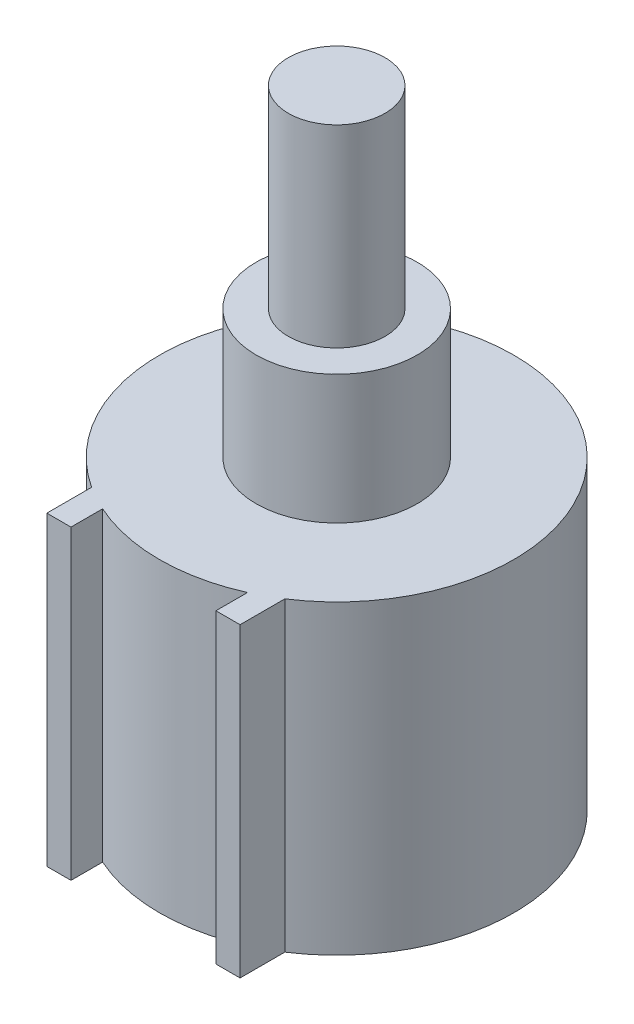
ISO-10303-21;
HEADER;
FILE_DESCRIPTION(('STEP AP214'),'2;1');
FILE_NAME('part.step','',(''),(''),'','','');
FILE_SCHEMA(('AUTOMOTIVE_DESIGN { 1 0 10303 214 1 1 1 1 }'));
ENDSEC;
DATA;
#1=APPLICATION_CONTEXT('core data for automotive mechanical design processes');
#2=APPLICATION_PROTOCOL_DEFINITION('international standard','automotive_design',2000,#1);
#3=PRODUCT_CONTEXT('',#1,'mechanical');
#4=PRODUCT('Part','Part','',(#3));
#5=PRODUCT_RELATED_PRODUCT_CATEGORY('part','',(#4));
#6=PRODUCT_DEFINITION_FORMATION('','',#4);
#7=PRODUCT_DEFINITION_CONTEXT('part definition',#1,'design');
#8=PRODUCT_DEFINITION('design','',#6,#7);
#9=PRODUCT_DEFINITION_SHAPE('','',#8);
#10=(LENGTH_UNIT() NAMED_UNIT(*) SI_UNIT(.MILLI.,.METRE.));
#11=(NAMED_UNIT(*) PLANE_ANGLE_UNIT() SI_UNIT($,.RADIAN.));
#12=(NAMED_UNIT(*) SI_UNIT($,.STERADIAN.) SOLID_ANGLE_UNIT());
#13=UNCERTAINTY_MEASURE_WITH_UNIT(LENGTH_MEASURE(1.E-05),#10,'distance_accuracy_value','');
#14=(GEOMETRIC_REPRESENTATION_CONTEXT(3) GLOBAL_UNCERTAINTY_ASSIGNED_CONTEXT((#13)) GLOBAL_UNIT_ASSIGNED_CONTEXT((#10,
#11,#12)) REPRESENTATION_CONTEXT('',''));
#15=CARTESIAN_POINT('',(0.,0.,0.));
#16=DIRECTION('',(0.,0.,1.));
#17=DIRECTION('',(1.,0.,0.));
#18=AXIS2_PLACEMENT_3D('',#15,#16,#17);
#19=CARTESIAN_POINT('',(0.,19.,0.));
#20=DIRECTION('',(0.,-1.,0.));
#21=DIRECTION('',(0.,0.,-1.));
#22=AXIS2_PLACEMENT_3D('',#19,#20,#21);
#23=CYLINDRICAL_SURFACE('',#22,11.);
#24=CARTESIAN_POINT('',(0.,0.,0.));
#25=DIRECTION('',(0.,1.,0.));
#26=DIRECTION('',(0.,0.,1.));
#27=AXIS2_PLACEMENT_3D('',#24,#25,#26);
#28=CIRCLE('',#27,11.);
#29=CARTESIAN_POINT('',(-4.5,0.,10.0374299499424));
#30=VERTEX_POINT('',#29);
#31=CARTESIAN_POINT('',(4.5,0.,10.0374299499424));
#32=VERTEX_POINT('',#31);
#33=EDGE_CURVE('E144',#30,#32,#28,.T.);
#34=ORIENTED_EDGE('',*,*,#33,.T.);
#35=DIRECTION('',(0.,-1.,0.));
#36=VECTOR('',#35,1.);
#37=CARTESIAN_POINT('',(4.5,19.,10.0374299499424));
#38=LINE('',#37,#36);
#39=CARTESIAN_POINT('',(4.5,19.,10.0374299499424));
#40=VERTEX_POINT('',#39);
#41=EDGE_CURVE('E48',#40,#32,#38,.T.);
#42=ORIENTED_EDGE('',*,*,#41,.F.);
#43=CARTESIAN_POINT('',(0.,19.,0.));
#44=DIRECTION('',(0.,1.,0.));
#45=DIRECTION('',(0.,0.,1.));
#46=AXIS2_PLACEMENT_3D('',#43,#44,#45);
#47=CIRCLE('',#46,11.);
#48=CARTESIAN_POINT('',(-4.5,19.,10.0374299499424));
#49=VERTEX_POINT('',#48);
#50=EDGE_CURVE('E159',#49,#40,#47,.T.);
#51=ORIENTED_EDGE('',*,*,#50,.F.);
#52=DIRECTION('',(0.,-1.,0.));
#53=VECTOR('',#52,1.);
#54=CARTESIAN_POINT('',(-4.5,19.,10.0374299499424));
#55=LINE('',#54,#53);
#56=EDGE_CURVE('E140',#49,#30,#55,.T.);
#57=ORIENTED_EDGE('',*,*,#56,.T.);
#58=EDGE_LOOP('',(#34,#42,#51,#57));
#59=FACE_BOUND('',#58,.T.);
#60=ADVANCED_FACE('F45',(#59),#23,.T.);
#61=CARTESIAN_POINT('',(4.5,19.,12.));
#62=DIRECTION('',(1.,0.,0.));
#63=DIRECTION('',(0.,0.,-1.));
#64=AXIS2_PLACEMENT_3D('',#61,#62,#63);
#65=PLANE('',#64);
#66=DIRECTION('',(0.,0.,1.));
#67=VECTOR('',#66,1.);
#68=CARTESIAN_POINT('',(4.5,0.,12.));
#69=LINE('',#68,#67);
#70=CARTESIAN_POINT('',(4.5,0.,12.));
#71=VERTEX_POINT('',#70);
#72=EDGE_CURVE('E147',#32,#71,#69,.T.);
#73=ORIENTED_EDGE('',*,*,#72,.T.);
#74=DIRECTION('',(0.,-1.,0.));
#75=VECTOR('',#74,1.);
#76=CARTESIAN_POINT('',(4.5,19.,12.));
#77=LINE('',#76,#75);
#78=CARTESIAN_POINT('',(4.5,19.,12.));
#79=VERTEX_POINT('',#78);
#80=EDGE_CURVE('E168',#79,#71,#77,.T.);
#81=ORIENTED_EDGE('',*,*,#80,.F.);
#82=DIRECTION('',(0.,0.,1.));
#83=VECTOR('',#82,1.);
#84=CARTESIAN_POINT('',(4.5,19.,12.));
#85=LINE('',#84,#83);
#86=EDGE_CURVE('E107',#40,#79,#85,.T.);
#87=ORIENTED_EDGE('',*,*,#86,.F.);
#88=ORIENTED_EDGE('',*,*,#41,.T.);
#89=EDGE_LOOP('',(#73,#81,#87,#88));
#90=FACE_BOUND('',#89,.T.);
#91=ADVANCED_FACE('F211',(#90),#65,.F.);
#92=CARTESIAN_POINT('',(4.5,19.,12.));
#93=DIRECTION('',(0.,0.,-1.));
#94=DIRECTION('',(-1.,0.,0.));
#95=AXIS2_PLACEMENT_3D('',#92,#93,#94);
#96=PLANE('',#95);
#97=DIRECTION('',(1.,0.,0.));
#98=VECTOR('',#97,1.);
#99=CARTESIAN_POINT('',(4.5,0.,12.));
#100=LINE('',#99,#98);
#101=CARTESIAN_POINT('',(6.,0.,12.));
#102=VERTEX_POINT('',#101);
#103=EDGE_CURVE('E150',#71,#102,#100,.T.);
#104=ORIENTED_EDGE('',*,*,#103,.T.);
#105=DIRECTION('',(0.,-1.,0.));
#106=VECTOR('',#105,1.);
#107=CARTESIAN_POINT('',(6.,19.,12.));
#108=LINE('',#107,#106);
#109=CARTESIAN_POINT('',(6.,19.,12.));
#110=VERTEX_POINT('',#109);
#111=EDGE_CURVE('E166',#110,#102,#108,.T.);
#112=ORIENTED_EDGE('',*,*,#111,.F.);
#113=DIRECTION('',(1.,0.,0.));
#114=VECTOR('',#113,1.);
#115=CARTESIAN_POINT('',(4.5,19.,12.));
#116=LINE('',#115,#114);
#117=EDGE_CURVE('E182',#79,#110,#116,.T.);
#118=ORIENTED_EDGE('',*,*,#117,.F.);
#119=ORIENTED_EDGE('',*,*,#80,.T.);
#120=EDGE_LOOP('',(#104,#112,#118,#119));
#121=FACE_BOUND('',#120,.T.);
#122=ADVANCED_FACE('F215',(#121),#96,.F.);
#123=CARTESIAN_POINT('',(6.,19.,12.));
#124=DIRECTION('',(-1.,0.,0.));
#125=DIRECTION('',(0.,0.,1.));
#126=AXIS2_PLACEMENT_3D('',#123,#124,#125);
#127=PLANE('',#126);
#128=DIRECTION('',(0.,0.,-1.));
#129=VECTOR('',#128,1.);
#130=CARTESIAN_POINT('',(6.,0.,12.));
#131=LINE('',#130,#129);
#132=CARTESIAN_POINT('',(6.,0.,9.21954445729289));
#133=VERTEX_POINT('',#132);
#134=EDGE_CURVE('E152',#102,#133,#131,.T.);
#135=ORIENTED_EDGE('',*,*,#134,.T.);
#136=DIRECTION('',(0.,-1.,0.));
#137=VECTOR('',#136,1.);
#138=CARTESIAN_POINT('',(6.,19.,9.21954445729289));
#139=LINE('',#138,#137);
#140=CARTESIAN_POINT('',(6.,19.,9.21954445729289));
#141=VERTEX_POINT('',#140);
#142=EDGE_CURVE('E163',#141,#133,#139,.T.);
#143=ORIENTED_EDGE('',*,*,#142,.F.);
#144=DIRECTION('',(0.,0.,-1.));
#145=VECTOR('',#144,1.);
#146=CARTESIAN_POINT('',(6.,19.,12.));
#147=LINE('',#146,#145);
#148=EDGE_CURVE('E184',#110,#141,#147,.T.);
#149=ORIENTED_EDGE('',*,*,#148,.F.);
#150=ORIENTED_EDGE('',*,*,#111,.T.);
#151=EDGE_LOOP('',(#135,#143,#149,#150));
#152=FACE_BOUND('',#151,.T.);
#153=ADVANCED_FACE('F189',(#152),#127,.F.);
#154=CARTESIAN_POINT('',(0.,19.,0.));
#155=DIRECTION('',(0.,-1.,0.));
#156=DIRECTION('',(0.,0.,-1.));
#157=AXIS2_PLACEMENT_3D('',#154,#155,#156);
#158=CYLINDRICAL_SURFACE('',#157,11.);
#159=CARTESIAN_POINT('',(0.,0.,0.));
#160=DIRECTION('',(0.,1.,0.));
#161=DIRECTION('',(0.,0.,1.));
#162=AXIS2_PLACEMENT_3D('',#159,#160,#161);
#163=CIRCLE('',#162,11.);
#164=CARTESIAN_POINT('',(-6.,0.,9.21954445729289));
#165=VERTEX_POINT('',#164);
#166=EDGE_CURVE('E154',#133,#165,#163,.T.);
#167=ORIENTED_EDGE('',*,*,#166,.T.);
#168=DIRECTION('',(0.,-1.,0.));
#169=VECTOR('',#168,1.);
#170=CARTESIAN_POINT('',(-6.,19.,9.21954445729289));
#171=LINE('',#170,#169);
#172=CARTESIAN_POINT('',(-6.,19.,9.21954445729289));
#173=VERTEX_POINT('',#172);
#174=EDGE_CURVE('E135',#173,#165,#171,.T.);
#175=ORIENTED_EDGE('',*,*,#174,.F.);
#176=CARTESIAN_POINT('',(0.,19.,0.));
#177=DIRECTION('',(0.,1.,0.));
#178=DIRECTION('',(0.,0.,1.));
#179=AXIS2_PLACEMENT_3D('',#176,#177,#178);
#180=CIRCLE('',#179,11.);
#181=EDGE_CURVE('E126',#141,#173,#180,.T.);
#182=ORIENTED_EDGE('',*,*,#181,.F.);
#183=ORIENTED_EDGE('',*,*,#142,.T.);
#184=EDGE_LOOP('',(#167,#175,#182,#183));
#185=FACE_BOUND('',#184,.T.);
#186=ADVANCED_FACE('F193',(#185),#158,.T.);
#187=CARTESIAN_POINT('',(-6.,19.,12.));
#188=DIRECTION('',(1.,0.,0.));
#189=DIRECTION('',(0.,0.,-1.));
#190=AXIS2_PLACEMENT_3D('',#187,#188,#189);
#191=PLANE('',#190);
#192=DIRECTION('',(0.,0.,1.));
#193=VECTOR('',#192,1.);
#194=CARTESIAN_POINT('',(-6.,0.,12.));
#195=LINE('',#194,#193);
#196=CARTESIAN_POINT('',(-6.,0.,12.));
#197=VERTEX_POINT('',#196);
#198=EDGE_CURVE('E134',#165,#197,#195,.T.);
#199=ORIENTED_EDGE('',*,*,#198,.T.);
#200=DIRECTION('',(0.,-1.,0.));
#201=VECTOR('',#200,1.);
#202=CARTESIAN_POINT('',(-6.,19.,12.));
#203=LINE('',#202,#201);
#204=CARTESIAN_POINT('',(-6.,19.,12.));
#205=VERTEX_POINT('',#204);
#206=EDGE_CURVE('E131',#205,#197,#203,.T.);
#207=ORIENTED_EDGE('',*,*,#206,.F.);
#208=DIRECTION('',(0.,0.,1.));
#209=VECTOR('',#208,1.);
#210=CARTESIAN_POINT('',(-6.,19.,12.));
#211=LINE('',#210,#209);
#212=EDGE_CURVE('E120',#173,#205,#211,.T.);
#213=ORIENTED_EDGE('',*,*,#212,.F.);
#214=ORIENTED_EDGE('',*,*,#174,.T.);
#215=EDGE_LOOP('',(#199,#207,#213,#214));
#216=FACE_BOUND('',#215,.T.);
#217=ADVANCED_FACE('F132',(#216),#191,.F.);
#218=CARTESIAN_POINT('',(-6.,19.,12.));
#219=DIRECTION('',(0.,0.,-1.));
#220=DIRECTION('',(-1.,0.,0.));
#221=AXIS2_PLACEMENT_3D('',#218,#219,#220);
#222=PLANE('',#221);
#223=DIRECTION('',(1.,0.,0.));
#224=VECTOR('',#223,1.);
#225=CARTESIAN_POINT('',(-6.,0.,12.));
#226=LINE('',#225,#224);
#227=CARTESIAN_POINT('',(-4.5,0.,12.));
#228=VERTEX_POINT('',#227);
#229=EDGE_CURVE('E92',#197,#228,#226,.T.);
#230=ORIENTED_EDGE('',*,*,#229,.T.);
#231=DIRECTION('',(0.,-1.,0.));
#232=VECTOR('',#231,1.);
#233=CARTESIAN_POINT('',(-4.5,19.,12.));
#234=LINE('',#233,#232);
#235=CARTESIAN_POINT('',(-4.5,19.,12.));
#236=VERTEX_POINT('',#235);
#237=EDGE_CURVE('E136',#236,#228,#234,.T.);
#238=ORIENTED_EDGE('',*,*,#237,.F.);
#239=DIRECTION('',(1.,0.,0.));
#240=VECTOR('',#239,1.);
#241=CARTESIAN_POINT('',(-6.,19.,12.));
#242=LINE('',#241,#240);
#243=EDGE_CURVE('E124',#205,#236,#242,.T.);
#244=ORIENTED_EDGE('',*,*,#243,.F.);
#245=ORIENTED_EDGE('',*,*,#206,.T.);
#246=EDGE_LOOP('',(#230,#238,#244,#245));
#247=FACE_BOUND('',#246,.T.);
#248=ADVANCED_FACE('F138',(#247),#222,.F.);
#249=CARTESIAN_POINT('',(-4.5,19.,12.));
#250=DIRECTION('',(-1.,0.,0.));
#251=DIRECTION('',(0.,0.,1.));
#252=AXIS2_PLACEMENT_3D('',#249,#250,#251);
#253=PLANE('',#252);
#254=DIRECTION('',(0.,0.,-1.));
#255=VECTOR('',#254,1.);
#256=CARTESIAN_POINT('',(-4.5,0.,12.));
#257=LINE('',#256,#255);
#258=EDGE_CURVE('E98',#228,#30,#257,.T.);
#259=ORIENTED_EDGE('',*,*,#258,.T.);
#260=ORIENTED_EDGE('',*,*,#56,.F.);
#261=DIRECTION('',(0.,0.,-1.));
#262=VECTOR('',#261,1.);
#263=CARTESIAN_POINT('',(-4.5,19.,12.));
#264=LINE('',#263,#262);
#265=EDGE_CURVE('E63',#236,#49,#264,.T.);
#266=ORIENTED_EDGE('',*,*,#265,.F.);
#267=ORIENTED_EDGE('',*,*,#237,.T.);
#268=EDGE_LOOP('',(#259,#260,#266,#267));
#269=FACE_BOUND('',#268,.T.);
#270=ADVANCED_FACE('F199',(#269),#253,.F.);
#271=CARTESIAN_POINT('',(0.,19.,0.));
#272=DIRECTION('',(0.,1.,0.));
#273=DIRECTION('',(0.,0.,1.));
#274=AXIS2_PLACEMENT_3D('',#271,#272,#273);
#275=PLANE('',#274);
#276=CARTESIAN_POINT('',(0.,19.,0.));
#277=DIRECTION('',(0.,1.,0.));
#278=DIRECTION('',(0.,0.,1.));
#279=AXIS2_PLACEMENT_3D('',#276,#277,#278);
#280=CIRCLE('',#279,5.);
#281=CARTESIAN_POINT('',(0.,19.,5.));
#282=VERTEX_POINT('',#281);
#283=EDGE_CURVE('E54',#282,#282,#280,.T.);
#284=ORIENTED_EDGE('',*,*,#283,.F.);
#285=EDGE_LOOP('',(#284));
#286=FACE_BOUND('',#285,.T.);
#287=ORIENTED_EDGE('',*,*,#50,.T.);
#288=ORIENTED_EDGE('',*,*,#86,.T.);
#289=ORIENTED_EDGE('',*,*,#117,.T.);
#290=ORIENTED_EDGE('',*,*,#148,.T.);
#291=ORIENTED_EDGE('',*,*,#181,.T.);
#292=ORIENTED_EDGE('',*,*,#212,.T.);
#293=ORIENTED_EDGE('',*,*,#243,.T.);
#294=ORIENTED_EDGE('',*,*,#265,.T.);
#295=EDGE_LOOP('',(#287,#288,#289,#290,#291,#292,#293,#294));
#296=FACE_BOUND('',#295,.T.);
#297=ADVANCED_FACE('F122',(#286,#296),#275,.T.);
#298=CARTESIAN_POINT('',(0.,0.,0.));
#299=DIRECTION('',(0.,1.,0.));
#300=DIRECTION('',(0.,0.,1.));
#301=AXIS2_PLACEMENT_3D('',#298,#299,#300);
#302=PLANE('',#301);
#303=ORIENTED_EDGE('',*,*,#33,.F.);
#304=ORIENTED_EDGE('',*,*,#258,.F.);
#305=ORIENTED_EDGE('',*,*,#229,.F.);
#306=ORIENTED_EDGE('',*,*,#198,.F.);
#307=ORIENTED_EDGE('',*,*,#166,.F.);
#308=ORIENTED_EDGE('',*,*,#134,.F.);
#309=ORIENTED_EDGE('',*,*,#103,.F.);
#310=ORIENTED_EDGE('',*,*,#72,.F.);
#311=EDGE_LOOP('',(#303,#304,#305,#306,#307,#308,#309,#310));
#312=FACE_BOUND('',#311,.T.);
#313=ADVANCED_FACE('F196',(#312),#302,.F.);
#314=CARTESIAN_POINT('',(0.,27.,0.));
#315=DIRECTION('',(0.,-1.,0.));
#316=DIRECTION('',(0.,0.,-1.));
#317=AXIS2_PLACEMENT_3D('',#314,#315,#316);
#318=CYLINDRICAL_SURFACE('',#317,5.);
#319=CARTESIAN_POINT('',(0.,27.,0.));
#320=DIRECTION('',(0.,1.,0.));
#321=DIRECTION('',(0.,0.,1.));
#322=AXIS2_PLACEMENT_3D('',#319,#320,#321);
#323=CIRCLE('',#322,5.);
#324=CARTESIAN_POINT('',(0.,27.,5.));
#325=VERTEX_POINT('',#324);
#326=EDGE_CURVE('E148',#325,#325,#323,.T.);
#327=ORIENTED_EDGE('',*,*,#326,.F.);
#328=EDGE_LOOP('',(#327));
#329=FACE_BOUND('',#328,.T.);
#330=ORIENTED_EDGE('',*,*,#283,.T.);
#331=EDGE_LOOP('',(#330));
#332=FACE_BOUND('',#331,.T.);
#333=ADVANCED_FACE('F254',(#329,#332),#318,.T.);
#334=CARTESIAN_POINT('',(0.,27.,0.));
#335=DIRECTION('',(0.,1.,0.));
#336=DIRECTION('',(0.,0.,1.));
#337=AXIS2_PLACEMENT_3D('',#334,#335,#336);
#338=PLANE('',#337);
#339=CARTESIAN_POINT('',(0.,27.,0.));
#340=DIRECTION('',(0.,1.,0.));
#341=DIRECTION('',(0.,0.,1.));
#342=AXIS2_PLACEMENT_3D('',#339,#340,#341);
#343=CIRCLE('',#342,3.);
#344=CARTESIAN_POINT('',(0.,27.,3.));
#345=VERTEX_POINT('',#344);
#346=EDGE_CURVE('E11',#345,#345,#343,.T.);
#347=ORIENTED_EDGE('',*,*,#346,.F.);
#348=EDGE_LOOP('',(#347));
#349=FACE_BOUND('',#348,.T.);
#350=ORIENTED_EDGE('',*,*,#326,.T.);
#351=EDGE_LOOP('',(#350));
#352=FACE_BOUND('',#351,.T.);
#353=ADVANCED_FACE('F261',(#349,#352),#338,.T.);
#354=CARTESIAN_POINT('',(0.,39.,0.));
#355=DIRECTION('',(0.,-1.,0.));
#356=DIRECTION('',(0.,0.,-1.));
#357=AXIS2_PLACEMENT_3D('',#354,#355,#356);
#358=CYLINDRICAL_SURFACE('',#357,3.);
#359=CARTESIAN_POINT('',(0.,39.,0.));
#360=DIRECTION('',(0.,1.,0.));
#361=DIRECTION('',(0.,0.,1.));
#362=AXIS2_PLACEMENT_3D('',#359,#360,#361);
#363=CIRCLE('',#362,3.);
#364=CARTESIAN_POINT('',(0.,39.,3.));
#365=VERTEX_POINT('',#364);
#366=EDGE_CURVE('E379',#365,#365,#363,.T.);
#367=ORIENTED_EDGE('',*,*,#366,.F.);
#368=EDGE_LOOP('',(#367));
#369=FACE_BOUND('',#368,.T.);
#370=ORIENTED_EDGE('',*,*,#346,.T.);
#371=EDGE_LOOP('',(#370));
#372=FACE_BOUND('',#371,.T.);
#373=ADVANCED_FACE('F271',(#369,#372),#358,.T.);
#374=CARTESIAN_POINT('',(0.,39.,0.));
#375=DIRECTION('',(0.,1.,0.));
#376=DIRECTION('',(0.,0.,1.));
#377=AXIS2_PLACEMENT_3D('',#374,#375,#376);
#378=PLANE('',#377);
#379=ORIENTED_EDGE('',*,*,#366,.T.);
#380=EDGE_LOOP('',(#379));
#381=FACE_BOUND('',#380,.T.);
#382=ADVANCED_FACE('F281',(#381),#378,.T.);
#383=CLOSED_SHELL('',(#60,#91,#122,#153,#186,#217,#248,#270,#297,#313,#333,#353,#373,#382));
#384=MANIFOLD_SOLID_BREP('B2',#383);
#385=ADVANCED_BREP_SHAPE_REPRESENTATION('',(#18,#384),#14);
#386=SHAPE_DEFINITION_REPRESENTATION(#9,#385);
ENDSEC;
END-ISO-10303-21;
